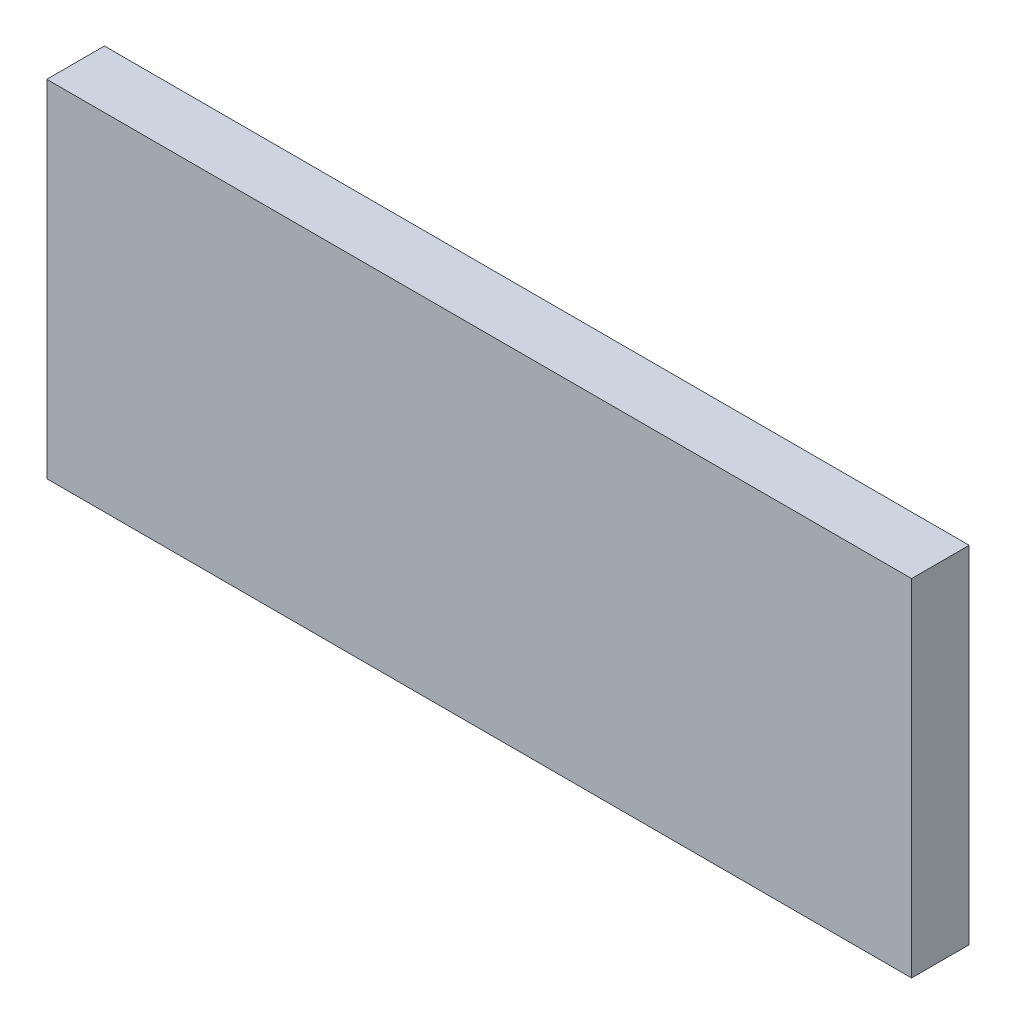
ISO-10303-21;
HEADER;
FILE_DESCRIPTION(('STEP AP214'),'2;1');
FILE_NAME('part.step','',(''),(''),'','','');
FILE_SCHEMA(('AUTOMOTIVE_DESIGN { 1 0 10303 214 1 1 1 1 }'));
ENDSEC;
DATA;
#1=APPLICATION_CONTEXT('core data for automotive mechanical design processes');
#2=APPLICATION_PROTOCOL_DEFINITION('international standard','automotive_design',2000,#1);
#3=PRODUCT_CONTEXT('',#1,'mechanical');
#4=PRODUCT('Part','Part','',(#3));
#5=PRODUCT_RELATED_PRODUCT_CATEGORY('part','',(#4));
#6=PRODUCT_DEFINITION_FORMATION('','',#4);
#7=PRODUCT_DEFINITION_CONTEXT('part definition',#1,'design');
#8=PRODUCT_DEFINITION('design','',#6,#7);
#9=PRODUCT_DEFINITION_SHAPE('','',#8);
#10=(LENGTH_UNIT() NAMED_UNIT(*) SI_UNIT(.MILLI.,.METRE.));
#11=(NAMED_UNIT(*) PLANE_ANGLE_UNIT() SI_UNIT($,.RADIAN.));
#12=(NAMED_UNIT(*) SI_UNIT($,.STERADIAN.) SOLID_ANGLE_UNIT());
#13=UNCERTAINTY_MEASURE_WITH_UNIT(LENGTH_MEASURE(1.E-05),#10,'distance_accuracy_value','');
#14=(GEOMETRIC_REPRESENTATION_CONTEXT(3) GLOBAL_UNCERTAINTY_ASSIGNED_CONTEXT((#13)) GLOBAL_UNIT_ASSIGNED_CONTEXT((#10,
#11,#12)) REPRESENTATION_CONTEXT('',''));
#15=CARTESIAN_POINT('',(0.,0.,0.));
#16=DIRECTION('',(0.,0.,1.));
#17=DIRECTION('',(1.,0.,0.));
#18=AXIS2_PLACEMENT_3D('',#15,#16,#17);
#19=CARTESIAN_POINT('',(-95.7888522318134,2.11875205254515,5.08));
#20=DIRECTION('',(-1.,0.,0.));
#21=DIRECTION('',(0.,0.,1.));
#22=AXIS2_PLACEMENT_3D('',#19,#20,#21);
#23=PLANE('',#22);
#24=DIRECTION('',(0.,1.,0.));
#25=VECTOR('',#24,1.);
#26=CARTESIAN_POINT('',(-95.7888522318134,2.11875205254515,0.));
#27=LINE('',#26,#25);
#28=CARTESIAN_POINT('',(-95.7888522318134,-28.3612479474548,0.));
#29=VERTEX_POINT('',#28);
#30=CARTESIAN_POINT('',(-95.7888522318134,2.11875205254515,0.));
#31=VERTEX_POINT('',#30);
#32=EDGE_CURVE('E96',#29,#31,#27,.T.);
#33=ORIENTED_EDGE('',*,*,#32,.T.);
#34=DIRECTION('',(0.,0.,-1.));
#35=VECTOR('',#34,1.);
#36=CARTESIAN_POINT('',(-95.7888522318134,2.11875205254515,5.08));
#37=LINE('',#36,#35);
#38=CARTESIAN_POINT('',(-95.7888522318134,2.11875205254515,5.08));
#39=VERTEX_POINT('',#38);
#40=EDGE_CURVE('E11',#39,#31,#37,.T.);
#41=ORIENTED_EDGE('',*,*,#40,.F.);
#42=DIRECTION('',(0.,1.,0.));
#43=VECTOR('',#42,1.);
#44=CARTESIAN_POINT('',(-95.7888522318134,2.11875205254515,5.08));
#45=LINE('',#44,#43);
#46=CARTESIAN_POINT('',(-95.7888522318134,-28.3612479474548,5.08));
#47=VERTEX_POINT('',#46);
#48=EDGE_CURVE('E84',#47,#39,#45,.T.);
#49=ORIENTED_EDGE('',*,*,#48,.F.);
#50=DIRECTION('',(0.,0.,-1.));
#51=VECTOR('',#50,1.);
#52=CARTESIAN_POINT('',(-95.7888522318134,-28.3612479474548,5.08));
#53=LINE('',#52,#51);
#54=EDGE_CURVE('E92',#47,#29,#53,.T.);
#55=ORIENTED_EDGE('',*,*,#54,.T.);
#56=EDGE_LOOP('',(#33,#41,#49,#55));
#57=FACE_BOUND('',#56,.T.);
#58=ADVANCED_FACE('F33',(#57),#23,.F.);
#59=CARTESIAN_POINT('',(-171.988852231813,2.11875205254515,5.08));
#60=DIRECTION('',(0.,-1.,0.));
#61=DIRECTION('',(0.,0.,-1.));
#62=AXIS2_PLACEMENT_3D('',#59,#60,#61);
#63=PLANE('',#62);
#64=DIRECTION('',(-1.,0.,0.));
#65=VECTOR('',#64,1.);
#66=CARTESIAN_POINT('',(-171.988852231813,2.11875205254515,0.));
#67=LINE('',#66,#65);
#68=CARTESIAN_POINT('',(-171.988852231813,2.11875205254515,0.));
#69=VERTEX_POINT('',#68);
#70=EDGE_CURVE('E88',#31,#69,#67,.T.);
#71=ORIENTED_EDGE('',*,*,#70,.T.);
#72=DIRECTION('',(0.,0.,-1.));
#73=VECTOR('',#72,1.);
#74=CARTESIAN_POINT('',(-171.988852231813,2.11875205254515,5.08));
#75=LINE('',#74,#73);
#76=CARTESIAN_POINT('',(-171.988852231813,2.11875205254515,5.08));
#77=VERTEX_POINT('',#76);
#78=EDGE_CURVE('E41',#77,#69,#75,.T.);
#79=ORIENTED_EDGE('',*,*,#78,.F.);
#80=DIRECTION('',(-1.,0.,0.));
#81=VECTOR('',#80,1.);
#82=CARTESIAN_POINT('',(-171.988852231813,2.11875205254515,5.08));
#83=LINE('',#82,#81);
#84=EDGE_CURVE('E79',#39,#77,#83,.T.);
#85=ORIENTED_EDGE('',*,*,#84,.F.);
#86=ORIENTED_EDGE('',*,*,#40,.T.);
#87=EDGE_LOOP('',(#71,#79,#85,#86));
#88=FACE_BOUND('',#87,.T.);
#89=ADVANCED_FACE('F87',(#88),#63,.F.);
#90=CARTESIAN_POINT('',(-171.988852231813,2.11875205254515,5.08));
#91=DIRECTION('',(1.,0.,0.));
#92=DIRECTION('',(0.,0.,-1.));
#93=AXIS2_PLACEMENT_3D('',#90,#91,#92);
#94=PLANE('',#93);
#95=DIRECTION('',(0.,-1.,0.));
#96=VECTOR('',#95,1.);
#97=CARTESIAN_POINT('',(-171.988852231813,2.11875205254515,0.));
#98=LINE('',#97,#96);
#99=CARTESIAN_POINT('',(-171.988852231813,-28.3612479474548,0.));
#100=VERTEX_POINT('',#99);
#101=EDGE_CURVE('E66',#69,#100,#98,.T.);
#102=ORIENTED_EDGE('',*,*,#101,.T.);
#103=DIRECTION('',(0.,0.,-1.));
#104=VECTOR('',#103,1.);
#105=CARTESIAN_POINT('',(-171.988852231813,-28.3612479474548,5.08));
#106=LINE('',#105,#104);
#107=CARTESIAN_POINT('',(-171.988852231813,-28.3612479474548,5.08));
#108=VERTEX_POINT('',#107);
#109=EDGE_CURVE('E89',#108,#100,#106,.T.);
#110=ORIENTED_EDGE('',*,*,#109,.F.);
#111=DIRECTION('',(0.,-1.,0.));
#112=VECTOR('',#111,1.);
#113=CARTESIAN_POINT('',(-171.988852231813,2.11875205254515,5.08));
#114=LINE('',#113,#112);
#115=EDGE_CURVE('E82',#77,#108,#114,.T.);
#116=ORIENTED_EDGE('',*,*,#115,.F.);
#117=ORIENTED_EDGE('',*,*,#78,.T.);
#118=EDGE_LOOP('',(#102,#110,#116,#117));
#119=FACE_BOUND('',#118,.T.);
#120=ADVANCED_FACE('F90',(#119),#94,.F.);
#121=CARTESIAN_POINT('',(-171.988852231813,-28.3612479474548,5.08));
#122=DIRECTION('',(0.,1.,0.));
#123=DIRECTION('',(0.,0.,1.));
#124=AXIS2_PLACEMENT_3D('',#121,#122,#123);
#125=PLANE('',#124);
#126=DIRECTION('',(1.,0.,0.));
#127=VECTOR('',#126,1.);
#128=CARTESIAN_POINT('',(-171.988852231813,-28.3612479474548,0.));
#129=LINE('',#128,#127);
#130=EDGE_CURVE('E72',#100,#29,#129,.T.);
#131=ORIENTED_EDGE('',*,*,#130,.T.);
#132=ORIENTED_EDGE('',*,*,#54,.F.);
#133=DIRECTION('',(1.,0.,0.));
#134=VECTOR('',#133,1.);
#135=CARTESIAN_POINT('',(-171.988852231813,-28.3612479474548,5.08));
#136=LINE('',#135,#134);
#137=EDGE_CURVE('E49',#108,#47,#136,.T.);
#138=ORIENTED_EDGE('',*,*,#137,.F.);
#139=ORIENTED_EDGE('',*,*,#109,.T.);
#140=EDGE_LOOP('',(#131,#132,#138,#139));
#141=FACE_BOUND('',#140,.T.);
#142=ADVANCED_FACE('F103',(#141),#125,.F.);
#143=CARTESIAN_POINT('',(-95.7888522318134,-28.3612479474548,5.08));
#144=DIRECTION('',(0.,0.,1.));
#145=DIRECTION('',(1.,0.,0.));
#146=AXIS2_PLACEMENT_3D('',#143,#144,#145);
#147=PLANE('',#146);
#148=ORIENTED_EDGE('',*,*,#48,.T.);
#149=ORIENTED_EDGE('',*,*,#84,.T.);
#150=ORIENTED_EDGE('',*,*,#115,.T.);
#151=ORIENTED_EDGE('',*,*,#137,.T.);
#152=EDGE_LOOP('',(#148,#149,#150,#151));
#153=FACE_BOUND('',#152,.T.);
#154=ADVANCED_FACE('F80',(#153),#147,.T.);
#155=CARTESIAN_POINT('',(-95.7888522318134,-28.3612479474548,0.));
#156=DIRECTION('',(0.,0.,1.));
#157=DIRECTION('',(1.,0.,0.));
#158=AXIS2_PLACEMENT_3D('',#155,#156,#157);
#159=PLANE('',#158);
#160=ORIENTED_EDGE('',*,*,#32,.F.);
#161=ORIENTED_EDGE('',*,*,#130,.F.);
#162=ORIENTED_EDGE('',*,*,#101,.F.);
#163=ORIENTED_EDGE('',*,*,#70,.F.);
#164=EDGE_LOOP('',(#160,#161,#162,#163));
#165=FACE_BOUND('',#164,.T.);
#166=ADVANCED_FACE('F106',(#165),#159,.F.);
#167=CLOSED_SHELL('',(#58,#89,#120,#142,#154,#166));
#168=MANIFOLD_SOLID_BREP('B2',#167);
#169=ADVANCED_BREP_SHAPE_REPRESENTATION('',(#18,#168),#14);
#170=SHAPE_DEFINITION_REPRESENTATION(#9,#169);
ENDSEC;
END-ISO-10303-21;
